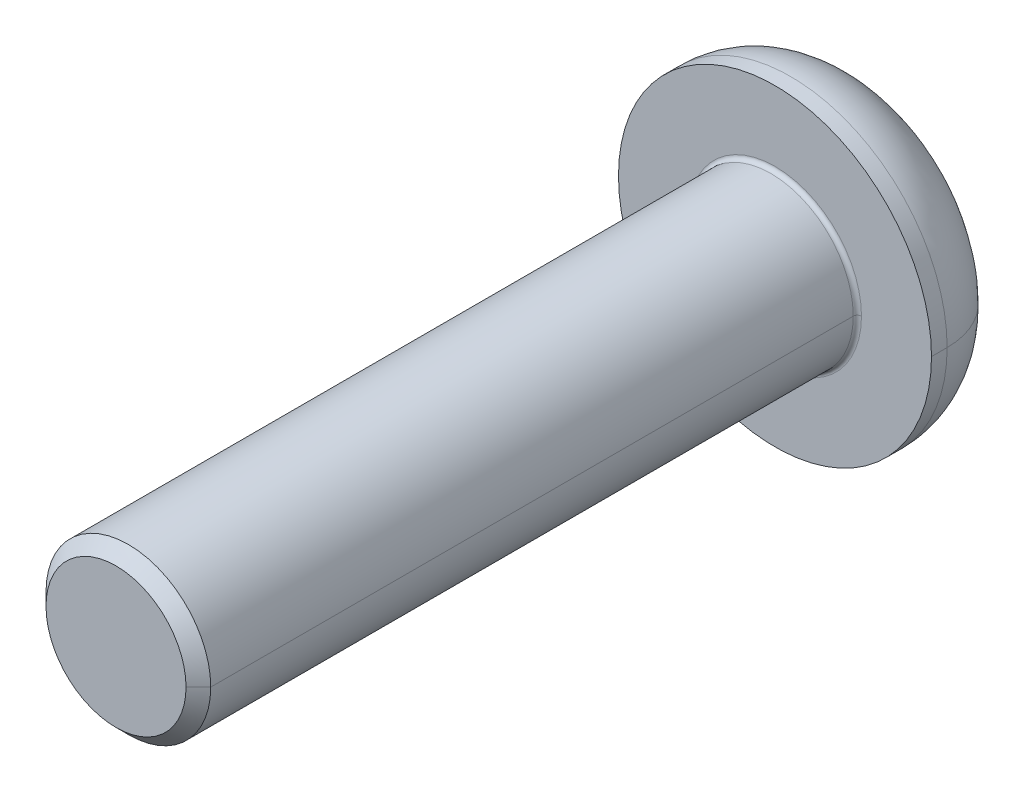
ISO-10303-21;
HEADER;
FILE_DESCRIPTION(('STEP AP214'),'2;1');
FILE_NAME('part.step','',(''),(''),'','','');
FILE_SCHEMA(('AUTOMOTIVE_DESIGN { 1 0 10303 214 1 1 1 1 }'));
ENDSEC;
DATA;
#1=APPLICATION_CONTEXT('core data for automotive mechanical design processes');
#2=APPLICATION_PROTOCOL_DEFINITION('international standard','automotive_design',2000,#1);
#3=PRODUCT_CONTEXT('',#1,'mechanical');
#4=PRODUCT('Part','Part','',(#3));
#5=PRODUCT_RELATED_PRODUCT_CATEGORY('part','',(#4));
#6=PRODUCT_DEFINITION_FORMATION('','',#4);
#7=PRODUCT_DEFINITION_CONTEXT('part definition',#1,'design');
#8=PRODUCT_DEFINITION('design','',#6,#7);
#9=PRODUCT_DEFINITION_SHAPE('','',#8);
#10=(LENGTH_UNIT() NAMED_UNIT(*) SI_UNIT(.MILLI.,.METRE.));
#11=(NAMED_UNIT(*) PLANE_ANGLE_UNIT() SI_UNIT($,.RADIAN.));
#12=(NAMED_UNIT(*) SI_UNIT($,.STERADIAN.) SOLID_ANGLE_UNIT());
#13=UNCERTAINTY_MEASURE_WITH_UNIT(LENGTH_MEASURE(1.E-05),#10,'distance_accuracy_value','');
#14=(GEOMETRIC_REPRESENTATION_CONTEXT(3) GLOBAL_UNCERTAINTY_ASSIGNED_CONTEXT((#13)) GLOBAL_UNIT_ASSIGNED_CONTEXT((#10,
#11,#12)) REPRESENTATION_CONTEXT('',''));
#15=CARTESIAN_POINT('',(0.,0.,0.));
#16=DIRECTION('',(0.,0.,1.));
#17=DIRECTION('',(1.,0.,0.));
#18=AXIS2_PLACEMENT_3D('',#15,#16,#17);
#19=CARTESIAN_POINT('',(0.,0.,0.1));
#20=DIRECTION('',(0.,0.,-1.));
#21=DIRECTION('',(-1.,0.,0.));
#22=AXIS2_PLACEMENT_3D('',#19,#20,#21);
#23=TOROIDAL_SURFACE('',#22,2.1,0.1);
#24=CARTESIAN_POINT('',(2.1,0.,0.1));
#25=DIRECTION('',(0.,1.,0.));
#26=DIRECTION('',(-1.,0.,0.));
#27=AXIS2_PLACEMENT_3D('',#24,#25,#26);
#28=CIRCLE('',#27,0.1);
#29=CARTESIAN_POINT('',(2.1,0.,0.));
#30=VERTEX_POINT('',#29);
#31=CARTESIAN_POINT('',(2.,0.,0.1));
#32=VERTEX_POINT('',#31);
#33=EDGE_CURVE('E272',#30,#32,#28,.T.);
#34=ORIENTED_EDGE('',*,*,#33,.F.);
#35=CARTESIAN_POINT('',(0.,0.,0.));
#36=DIRECTION('',(0.,0.,-1.));
#37=DIRECTION('',(-1.,0.,0.));
#38=AXIS2_PLACEMENT_3D('',#35,#36,#37);
#39=CIRCLE('',#38,2.1);
#40=CARTESIAN_POINT('',(-2.1,0.,0.));
#41=VERTEX_POINT('',#40);
#42=EDGE_CURVE('E163',#41,#30,#39,.T.);
#43=ORIENTED_EDGE('',*,*,#42,.F.);
#44=CARTESIAN_POINT('',(-2.1,0.,0.1));
#45=DIRECTION('',(0.,-1.,0.));
#46=DIRECTION('',(0.,0.,-1.));
#47=AXIS2_PLACEMENT_3D('',#44,#45,#46);
#48=CIRCLE('',#47,0.1);
#49=CARTESIAN_POINT('',(-2.,0.,0.1));
#50=VERTEX_POINT('',#49);
#51=EDGE_CURVE('E286',#41,#50,#48,.T.);
#52=ORIENTED_EDGE('',*,*,#51,.T.);
#53=CARTESIAN_POINT('',(0.,0.,0.1));
#54=DIRECTION('',(0.,0.,1.));
#55=DIRECTION('',(-1.,0.,0.));
#56=AXIS2_PLACEMENT_3D('',#53,#54,#55);
#57=CIRCLE('',#56,2.);
#58=EDGE_CURVE('E281',#32,#50,#57,.T.);
#59=ORIENTED_EDGE('',*,*,#58,.F.);
#60=EDGE_LOOP('',(#34,#43,#52,#59));
#61=FACE_BOUND('',#60,.T.);
#62=ADVANCED_FACE('F17',(#61),#23,.F.);
#63=CARTESIAN_POINT('',(0.,0.,-0.38));
#64=DIRECTION('',(0.,0.,-1.));
#65=DIRECTION('',(-1.,0.,0.));
#66=AXIS2_PLACEMENT_3D('',#63,#64,#65);
#67=TOROIDAL_SURFACE('',#66,1.98,1.82);
#68=CARTESIAN_POINT('',(1.98,0.,-0.38));
#69=DIRECTION('',(0.,1.,0.));
#70=DIRECTION('',(-1.,0.,0.));
#71=AXIS2_PLACEMENT_3D('',#68,#69,#70);
#72=CIRCLE('',#71,1.82);
#73=CARTESIAN_POINT('',(3.8,0.,-0.38));
#74=VERTEX_POINT('',#73);
#75=CARTESIAN_POINT('',(1.98,0.,-2.2));
#76=VERTEX_POINT('',#75);
#77=EDGE_CURVE('E290',#74,#76,#72,.T.);
#78=ORIENTED_EDGE('',*,*,#77,.F.);
#79=CARTESIAN_POINT('',(0.,0.,-0.38));
#80=DIRECTION('',(0.,0.,1.));
#81=DIRECTION('',(-1.,0.,0.));
#82=AXIS2_PLACEMENT_3D('',#79,#80,#81);
#83=CIRCLE('',#82,3.8);
#84=CARTESIAN_POINT('',(-3.8,0.,-0.38));
#85=VERTEX_POINT('',#84);
#86=EDGE_CURVE('E246',#85,#74,#83,.T.);
#87=ORIENTED_EDGE('',*,*,#86,.F.);
#88=CARTESIAN_POINT('',(-1.98,0.,-0.38));
#89=DIRECTION('',(0.,-1.,0.));
#90=DIRECTION('',(0.,0.,-1.));
#91=AXIS2_PLACEMENT_3D('',#88,#89,#90);
#92=CIRCLE('',#91,1.82);
#93=CARTESIAN_POINT('',(-1.98,0.,-2.2));
#94=VERTEX_POINT('',#93);
#95=EDGE_CURVE('E297',#85,#94,#92,.T.);
#96=ORIENTED_EDGE('',*,*,#95,.T.);
#97=CARTESIAN_POINT('',(0.,0.,-2.2));
#98=DIRECTION('',(0.,0.,-1.));
#99=DIRECTION('',(-1.,0.,0.));
#100=AXIS2_PLACEMENT_3D('',#97,#98,#99);
#101=CIRCLE('',#100,1.98);
#102=EDGE_CURVE('E227',#76,#94,#101,.T.);
#103=ORIENTED_EDGE('',*,*,#102,.F.);
#104=EDGE_LOOP('',(#78,#87,#96,#103));
#105=FACE_BOUND('',#104,.T.);
#106=ADVANCED_FACE('F376',(#105),#67,.T.);
#107=CARTESIAN_POINT('',(0.,0.,-0.9));
#108=DIRECTION('',(0.,0.,-1.));
#109=DIRECTION('',(0.,-1.,0.));
#110=AXIS2_PLACEMENT_3D('',#107,#108,#109);
#111=PLANE('',#110);
#112=DIRECTION('',(-1.,0.,0.));
#113=VECTOR('',#112,1.);
#114=CARTESIAN_POINT('',(0.721687836487032,-1.25,-0.9));
#115=LINE('',#114,#113);
#116=CARTESIAN_POINT('',(0.721687836487032,-1.25,-0.9));
#117=VERTEX_POINT('',#116);
#118=CARTESIAN_POINT('',(-0.721687836487032,-1.25,-0.9));
#119=VERTEX_POINT('',#118);
#120=EDGE_CURVE('E149',#117,#119,#115,.T.);
#121=ORIENTED_EDGE('',*,*,#120,.T.);
#122=DIRECTION('',(-0.5,0.866025403784439,0.));
#123=VECTOR('',#122,1.);
#124=CARTESIAN_POINT('',(-0.721687836487032,-1.25,-0.9));
#125=LINE('',#124,#123);
#126=CARTESIAN_POINT('',(-1.44337567297406,0.,-0.9));
#127=VERTEX_POINT('',#126);
#128=EDGE_CURVE('E11',#119,#127,#125,.T.);
#129=ORIENTED_EDGE('',*,*,#128,.T.);
#130=DIRECTION('',(0.5,0.866025403784439,0.));
#131=VECTOR('',#130,1.);
#132=CARTESIAN_POINT('',(-1.44337567297406,0.,-0.9));
#133=LINE('',#132,#131);
#134=CARTESIAN_POINT('',(-0.721687836487033,1.25,-0.9));
#135=VERTEX_POINT('',#134);
#136=EDGE_CURVE('E20',#127,#135,#133,.T.);
#137=ORIENTED_EDGE('',*,*,#136,.T.);
#138=DIRECTION('',(1.,0.,0.));
#139=VECTOR('',#138,1.);
#140=CARTESIAN_POINT('',(-0.721687836487033,1.25,-0.9));
#141=LINE('',#140,#139);
#142=CARTESIAN_POINT('',(0.721687836487032,1.25,-0.9));
#143=VERTEX_POINT('',#142);
#144=EDGE_CURVE('E183',#135,#143,#141,.T.);
#145=ORIENTED_EDGE('',*,*,#144,.T.);
#146=DIRECTION('',(0.5,-0.866025403784439,0.));
#147=VECTOR('',#146,1.);
#148=CARTESIAN_POINT('',(0.721687836487032,1.25,-0.9));
#149=LINE('',#148,#147);
#150=CARTESIAN_POINT('',(1.44337567297406,0.,-0.9));
#151=VERTEX_POINT('',#150);
#152=EDGE_CURVE('E178',#143,#151,#149,.T.);
#153=ORIENTED_EDGE('',*,*,#152,.T.);
#154=DIRECTION('',(-0.5,-0.866025403784439,0.));
#155=VECTOR('',#154,1.);
#156=CARTESIAN_POINT('',(1.44337567297406,0.,-0.9));
#157=LINE('',#156,#155);
#158=EDGE_CURVE('E152',#151,#117,#157,.T.);
#159=ORIENTED_EDGE('',*,*,#158,.T.);
#160=EDGE_LOOP('',(#121,#129,#137,#145,#153,#159));
#161=FACE_BOUND('',#160,.T.);
#162=ADVANCED_FACE('F150',(#161),#111,.T.);
#163=CARTESIAN_POINT('',(-0.721687836487032,-1.25,-0.9));
#164=DIRECTION('',(-0.866025403784439,-0.5,0.));
#165=DIRECTION('',(-0.5,0.866025403784439,0.));
#166=AXIS2_PLACEMENT_3D('',#163,#164,#165);
#167=PLANE('',#166);
#168=DIRECTION('',(-0.5,0.866025403784439,0.));
#169=VECTOR('',#168,1.);
#170=CARTESIAN_POINT('',(-0.721687836487032,-1.25,-2.2));
#171=LINE('',#170,#169);
#172=CARTESIAN_POINT('',(-0.721687836487032,-1.25,-2.2));
#173=VERTEX_POINT('',#172);
#174=CARTESIAN_POINT('',(-1.44337567297406,0.,-2.2));
#175=VERTEX_POINT('',#174);
#176=EDGE_CURVE('E169',#173,#175,#171,.T.);
#177=ORIENTED_EDGE('',*,*,#176,.T.);
#178=DIRECTION('',(0.,0.,-1.));
#179=VECTOR('',#178,1.);
#180=CARTESIAN_POINT('',(-1.44337567297406,0.,-0.9));
#181=LINE('',#180,#179);
#182=EDGE_CURVE('E26',#127,#175,#181,.T.);
#183=ORIENTED_EDGE('',*,*,#182,.F.);
#184=ORIENTED_EDGE('',*,*,#128,.F.);
#185=DIRECTION('',(0.,0.,-1.));
#186=VECTOR('',#185,1.);
#187=CARTESIAN_POINT('',(-0.721687836487032,-1.25,-0.9));
#188=LINE('',#187,#186);
#189=EDGE_CURVE('E146',#119,#173,#188,.T.);
#190=ORIENTED_EDGE('',*,*,#189,.T.);
#191=EDGE_LOOP('',(#177,#183,#184,#190));
#192=FACE_BOUND('',#191,.T.);
#193=ADVANCED_FACE('F144',(#192),#167,.F.);
#194=CARTESIAN_POINT('',(-1.44337567297406,0.,-0.9));
#195=DIRECTION('',(-0.866025403784439,0.5,0.));
#196=DIRECTION('',(0.,0.,1.));
#197=AXIS2_PLACEMENT_3D('',#194,#195,#196);
#198=PLANE('',#197);
#199=DIRECTION('',(0.5,0.866025403784439,0.));
#200=VECTOR('',#199,1.);
#201=CARTESIAN_POINT('',(-1.44337567297406,0.,-2.2));
#202=LINE('',#201,#200);
#203=CARTESIAN_POINT('',(-0.721687836487033,1.25,-2.2));
#204=VERTEX_POINT('',#203);
#205=EDGE_CURVE('E199',#175,#204,#202,.T.);
#206=ORIENTED_EDGE('',*,*,#205,.T.);
#207=DIRECTION('',(0.,0.,-1.));
#208=VECTOR('',#207,1.);
#209=CARTESIAN_POINT('',(-0.721687836487033,1.25,-0.9));
#210=LINE('',#209,#208);
#211=EDGE_CURVE('E185',#135,#204,#210,.T.);
#212=ORIENTED_EDGE('',*,*,#211,.F.);
#213=ORIENTED_EDGE('',*,*,#136,.F.);
#214=ORIENTED_EDGE('',*,*,#182,.T.);
#215=EDGE_LOOP('',(#206,#212,#213,#214));
#216=FACE_BOUND('',#215,.T.);
#217=ADVANCED_FACE('F396',(#216),#198,.F.);
#218=CARTESIAN_POINT('',(-0.721687836487033,1.25,-0.9));
#219=DIRECTION('',(0.,1.,0.));
#220=DIRECTION('',(1.,0.,0.));
#221=AXIS2_PLACEMENT_3D('',#218,#219,#220);
#222=PLANE('',#221);
#223=DIRECTION('',(1.,0.,0.));
#224=VECTOR('',#223,1.);
#225=CARTESIAN_POINT('',(-0.721687836487033,1.25,-2.2));
#226=LINE('',#225,#224);
#227=CARTESIAN_POINT('',(0.721687836487032,1.25,-2.2));
#228=VERTEX_POINT('',#227);
#229=EDGE_CURVE('E218',#204,#228,#226,.T.);
#230=ORIENTED_EDGE('',*,*,#229,.T.);
#231=DIRECTION('',(0.,0.,-1.));
#232=VECTOR('',#231,1.);
#233=CARTESIAN_POINT('',(0.721687836487032,1.25,-0.9));
#234=LINE('',#233,#232);
#235=EDGE_CURVE('E181',#143,#228,#234,.T.);
#236=ORIENTED_EDGE('',*,*,#235,.F.);
#237=ORIENTED_EDGE('',*,*,#144,.F.);
#238=ORIENTED_EDGE('',*,*,#211,.T.);
#239=EDGE_LOOP('',(#230,#236,#237,#238));
#240=FACE_BOUND('',#239,.T.);
#241=ADVANCED_FACE('F401',(#240),#222,.F.);
#242=CARTESIAN_POINT('',(0.721687836487032,1.25,-0.9));
#243=DIRECTION('',(0.866025403784439,0.5,0.));
#244=DIRECTION('',(0.,0.,-1.));
#245=AXIS2_PLACEMENT_3D('',#242,#243,#244);
#246=PLANE('',#245);
#247=DIRECTION('',(0.5,-0.866025403784439,0.));
#248=VECTOR('',#247,1.);
#249=CARTESIAN_POINT('',(0.721687836487032,1.25,-2.2));
#250=LINE('',#249,#248);
#251=CARTESIAN_POINT('',(1.44337567297406,0.,-2.2));
#252=VERTEX_POINT('',#251);
#253=EDGE_CURVE('E213',#228,#252,#250,.T.);
#254=ORIENTED_EDGE('',*,*,#253,.T.);
#255=DIRECTION('',(0.,0.,-1.));
#256=VECTOR('',#255,1.);
#257=CARTESIAN_POINT('',(1.44337567297406,0.,-0.9));
#258=LINE('',#257,#256);
#259=EDGE_CURVE('E177',#151,#252,#258,.T.);
#260=ORIENTED_EDGE('',*,*,#259,.F.);
#261=ORIENTED_EDGE('',*,*,#152,.F.);
#262=ORIENTED_EDGE('',*,*,#235,.T.);
#263=EDGE_LOOP('',(#254,#260,#261,#262));
#264=FACE_BOUND('',#263,.T.);
#265=ADVANCED_FACE('F214',(#264),#246,.F.);
#266=CARTESIAN_POINT('',(1.44337567297406,0.,-0.9));
#267=DIRECTION('',(0.866025403784439,-0.5,0.));
#268=DIRECTION('',(0.,0.,-1.));
#269=AXIS2_PLACEMENT_3D('',#266,#267,#268);
#270=PLANE('',#269);
#271=DIRECTION('',(-0.5,-0.866025403784439,0.));
#272=VECTOR('',#271,1.);
#273=CARTESIAN_POINT('',(1.44337567297406,0.,-2.2));
#274=LINE('',#273,#272);
#275=CARTESIAN_POINT('',(0.721687836487032,-1.25,-2.2));
#276=VERTEX_POINT('',#275);
#277=EDGE_CURVE('E209',#252,#276,#274,.T.);
#278=ORIENTED_EDGE('',*,*,#277,.T.);
#279=DIRECTION('',(0.,0.,-1.));
#280=VECTOR('',#279,1.);
#281=CARTESIAN_POINT('',(0.721687836487032,-1.25,-0.9));
#282=LINE('',#281,#280);
#283=EDGE_CURVE('E156',#117,#276,#282,.T.);
#284=ORIENTED_EDGE('',*,*,#283,.F.);
#285=ORIENTED_EDGE('',*,*,#158,.F.);
#286=ORIENTED_EDGE('',*,*,#259,.T.);
#287=EDGE_LOOP('',(#278,#284,#285,#286));
#288=FACE_BOUND('',#287,.T.);
#289=ADVANCED_FACE('F207',(#288),#270,.F.);
#290=CARTESIAN_POINT('',(0.721687836487032,-1.25,-0.9));
#291=DIRECTION('',(0.,-1.,0.));
#292=DIRECTION('',(-1.,0.,0.));
#293=AXIS2_PLACEMENT_3D('',#290,#291,#292);
#294=PLANE('',#293);
#295=DIRECTION('',(-1.,0.,0.));
#296=VECTOR('',#295,1.);
#297=CARTESIAN_POINT('',(0.721687836487032,-1.25,-2.2));
#298=LINE('',#297,#296);
#299=EDGE_CURVE('E161',#276,#173,#298,.T.);
#300=ORIENTED_EDGE('',*,*,#299,.T.);
#301=ORIENTED_EDGE('',*,*,#189,.F.);
#302=ORIENTED_EDGE('',*,*,#120,.F.);
#303=ORIENTED_EDGE('',*,*,#283,.T.);
#304=EDGE_LOOP('',(#300,#301,#302,#303));
#305=FACE_BOUND('',#304,.T.);
#306=ADVANCED_FACE('F159',(#305),#294,.F.);
#307=CARTESIAN_POINT('',(0.,0.,0.));
#308=DIRECTION('',(0.,0.,-1.));
#309=DIRECTION('',(0.,-1.,0.));
#310=AXIS2_PLACEMENT_3D('',#307,#308,#309);
#311=PLANE('',#310);
#312=ORIENTED_EDGE('',*,*,#42,.T.);
#313=CARTESIAN_POINT('',(0.,0.,0.));
#314=DIRECTION('',(0.,0.,-1.));
#315=DIRECTION('',(-1.,0.,0.));
#316=AXIS2_PLACEMENT_3D('',#313,#314,#315);
#317=CIRCLE('',#316,2.1);
#318=EDGE_CURVE('E268',#30,#41,#317,.T.);
#319=ORIENTED_EDGE('',*,*,#318,.T.);
#320=EDGE_LOOP('',(#312,#319));
#321=FACE_BOUND('',#320,.T.);
#322=CARTESIAN_POINT('',(0.,0.,0.));
#323=DIRECTION('',(0.,0.,-1.));
#324=DIRECTION('',(-1.,0.,0.));
#325=AXIS2_PLACEMENT_3D('',#322,#323,#324);
#326=CIRCLE('',#325,3.8);
#327=CARTESIAN_POINT('',(3.8,0.,0.));
#328=VERTEX_POINT('',#327);
#329=CARTESIAN_POINT('',(-3.8,0.,0.));
#330=VERTEX_POINT('',#329);
#331=EDGE_CURVE('E249',#328,#330,#326,.T.);
#332=ORIENTED_EDGE('',*,*,#331,.F.);
#333=CARTESIAN_POINT('',(0.,0.,0.));
#334=DIRECTION('',(0.,0.,-1.));
#335=DIRECTION('',(-1.,0.,0.));
#336=AXIS2_PLACEMENT_3D('',#333,#334,#335);
#337=CIRCLE('',#336,3.8);
#338=EDGE_CURVE('E304',#330,#328,#337,.T.);
#339=ORIENTED_EDGE('',*,*,#338,.F.);
#340=EDGE_LOOP('',(#332,#339));
#341=FACE_BOUND('',#340,.T.);
#342=ADVANCED_FACE('F360',(#321,#341),#311,.F.);
#343=CARTESIAN_POINT('',(0.,0.,-2.2));
#344=DIRECTION('',(0.,0.,-1.));
#345=DIRECTION('',(0.,-1.,0.));
#346=AXIS2_PLACEMENT_3D('',#343,#344,#345);
#347=PLANE('',#346);
#348=ORIENTED_EDGE('',*,*,#299,.F.);
#349=ORIENTED_EDGE('',*,*,#277,.F.);
#350=ORIENTED_EDGE('',*,*,#253,.F.);
#351=ORIENTED_EDGE('',*,*,#229,.F.);
#352=ORIENTED_EDGE('',*,*,#205,.F.);
#353=ORIENTED_EDGE('',*,*,#176,.F.);
#354=EDGE_LOOP('',(#348,#349,#350,#351,#352,#353));
#355=FACE_BOUND('',#354,.T.);
#356=CARTESIAN_POINT('',(0.,0.,-2.2));
#357=DIRECTION('',(0.,0.,-1.));
#358=DIRECTION('',(-1.,0.,0.));
#359=AXIS2_PLACEMENT_3D('',#356,#357,#358);
#360=CIRCLE('',#359,1.98);
#361=EDGE_CURVE('E294',#94,#76,#360,.T.);
#362=ORIENTED_EDGE('',*,*,#361,.T.);
#363=ORIENTED_EDGE('',*,*,#102,.T.);
#364=EDGE_LOOP('',(#362,#363));
#365=FACE_BOUND('',#364,.T.);
#366=ADVANCED_FACE('F220',(#355,#365),#347,.T.);
#367=CARTESIAN_POINT('',(0.,0.,-2.2));
#368=DIRECTION('',(0.,0.,1.));
#369=DIRECTION('',(1.,0.,0.));
#370=AXIS2_PLACEMENT_3D('',#367,#368,#369);
#371=CYLINDRICAL_SURFACE('',#370,3.8);
#372=DIRECTION('',(0.,0.,1.));
#373=VECTOR('',#372,1.);
#374=CARTESIAN_POINT('',(-3.8,0.,-2.2));
#375=LINE('',#374,#373);
#376=EDGE_CURVE('E300',#85,#330,#375,.T.);
#377=ORIENTED_EDGE('',*,*,#376,.F.);
#378=ORIENTED_EDGE('',*,*,#86,.T.);
#379=DIRECTION('',(0.,0.,1.));
#380=VECTOR('',#379,1.);
#381=CARTESIAN_POINT('',(3.8,0.,-2.2));
#382=LINE('',#381,#380);
#383=EDGE_CURVE('E308',#74,#328,#382,.T.);
#384=ORIENTED_EDGE('',*,*,#383,.T.);
#385=ORIENTED_EDGE('',*,*,#331,.T.);
#386=EDGE_LOOP('',(#377,#378,#384,#385));
#387=FACE_BOUND('',#386,.T.);
#388=ADVANCED_FACE('F365',(#387),#371,.T.);
#389=CARTESIAN_POINT('',(0.,0.,16.));
#390=DIRECTION('',(0.,0.,-1.));
#391=DIRECTION('',(-1.,0.,0.));
#392=AXIS2_PLACEMENT_3D('',#389,#390,#391);
#393=CONICAL_SURFACE('',#392,1.7,0.785398163397442);
#394=DIRECTION('',(0.707106781186544,0.,-0.707106781186552));
#395=VECTOR('',#394,1.);
#396=CARTESIAN_POINT('',(1.7,0.,16.));
#397=LINE('',#396,#395);
#398=CARTESIAN_POINT('',(1.7,0.,16.));
#399=VERTEX_POINT('',#398);
#400=CARTESIAN_POINT('',(2.,0.,15.7));
#401=VERTEX_POINT('',#400);
#402=EDGE_CURVE('E315',#399,#401,#397,.T.);
#403=ORIENTED_EDGE('',*,*,#402,.F.);
#404=CARTESIAN_POINT('',(0.,0.,16.));
#405=DIRECTION('',(0.,0.,1.));
#406=DIRECTION('',(1.,0.,0.));
#407=AXIS2_PLACEMENT_3D('',#404,#405,#406);
#408=CIRCLE('',#407,1.7);
#409=CARTESIAN_POINT('',(-1.7,0.,16.));
#410=VERTEX_POINT('',#409);
#411=EDGE_CURVE('E263',#410,#399,#408,.T.);
#412=ORIENTED_EDGE('',*,*,#411,.F.);
#413=DIRECTION('',(-0.707106781186544,0.,-0.707106781186552));
#414=VECTOR('',#413,1.);
#415=CARTESIAN_POINT('',(-1.7,0.,16.));
#416=LINE('',#415,#414);
#417=CARTESIAN_POINT('',(-2.,0.,15.7));
#418=VERTEX_POINT('',#417);
#419=EDGE_CURVE('E282',#410,#418,#416,.T.);
#420=ORIENTED_EDGE('',*,*,#419,.T.);
#421=CARTESIAN_POINT('',(0.,0.,15.7));
#422=DIRECTION('',(0.,0.,-1.));
#423=DIRECTION('',(1.,0.,0.));
#424=AXIS2_PLACEMENT_3D('',#421,#422,#423);
#425=CIRCLE('',#424,2.);
#426=EDGE_CURVE('E328',#401,#418,#425,.T.);
#427=ORIENTED_EDGE('',*,*,#426,.F.);
#428=EDGE_LOOP('',(#403,#412,#420,#427));
#429=FACE_BOUND('',#428,.T.);
#430=ADVANCED_FACE('F341',(#429),#393,.T.);
#431=CARTESIAN_POINT('',(0.,0.,16.));
#432=DIRECTION('',(0.,0.,1.));
#433=DIRECTION('',(1.,0.,0.));
#434=AXIS2_PLACEMENT_3D('',#431,#432,#433);
#435=PLANE('',#434);
#436=ORIENTED_EDGE('',*,*,#411,.T.);
#437=CARTESIAN_POINT('',(0.,0.,16.));
#438=DIRECTION('',(0.,0.,1.));
#439=DIRECTION('',(1.,0.,0.));
#440=AXIS2_PLACEMENT_3D('',#437,#438,#439);
#441=CIRCLE('',#440,1.7);
#442=EDGE_CURVE('E311',#399,#410,#441,.T.);
#443=ORIENTED_EDGE('',*,*,#442,.T.);
#444=EDGE_LOOP('',(#436,#443));
#445=FACE_BOUND('',#444,.T.);
#446=ADVANCED_FACE('F336',(#445),#435,.T.);
#447=CARTESIAN_POINT('',(0.,0.,16.));
#448=DIRECTION('',(0.,0.,-1.));
#449=DIRECTION('',(-1.,0.,0.));
#450=AXIS2_PLACEMENT_3D('',#447,#448,#449);
#451=CYLINDRICAL_SURFACE('',#450,2.);
#452=DIRECTION('',(0.,0.,-1.));
#453=VECTOR('',#452,1.);
#454=CARTESIAN_POINT('',(2.,0.,16.));
#455=LINE('',#454,#453);
#456=EDGE_CURVE('E277',#401,#32,#455,.T.);
#457=ORIENTED_EDGE('',*,*,#456,.F.);
#458=ORIENTED_EDGE('',*,*,#426,.T.);
#459=DIRECTION('',(0.,0.,-1.));
#460=VECTOR('',#459,1.);
#461=CARTESIAN_POINT('',(-2.,0.,16.));
#462=LINE('',#461,#460);
#463=EDGE_CURVE('E326',#418,#50,#462,.T.);
#464=ORIENTED_EDGE('',*,*,#463,.T.);
#465=CARTESIAN_POINT('',(0.,0.,0.1));
#466=DIRECTION('',(0.,0.,1.));
#467=DIRECTION('',(-1.,0.,0.));
#468=AXIS2_PLACEMENT_3D('',#465,#466,#467);
#469=CIRCLE('',#468,2.);
#470=EDGE_CURVE('E276',#50,#32,#469,.T.);
#471=ORIENTED_EDGE('',*,*,#470,.T.);
#472=EDGE_LOOP('',(#457,#458,#464,#471));
#473=FACE_BOUND('',#472,.T.);
#474=ADVANCED_FACE('F351',(#473),#451,.T.);
#475=CARTESIAN_POINT('',(0.,0.,16.));
#476=DIRECTION('',(0.,0.,-1.));
#477=DIRECTION('',(-1.,0.,0.));
#478=AXIS2_PLACEMENT_3D('',#475,#476,#477);
#479=CYLINDRICAL_SURFACE('',#478,2.);
#480=CARTESIAN_POINT('',(0.,0.,15.7));
#481=DIRECTION('',(0.,0.,-1.));
#482=DIRECTION('',(1.,0.,0.));
#483=AXIS2_PLACEMENT_3D('',#480,#481,#482);
#484=CIRCLE('',#483,2.);
#485=EDGE_CURVE('E319',#418,#401,#484,.T.);
#486=ORIENTED_EDGE('',*,*,#485,.T.);
#487=ORIENTED_EDGE('',*,*,#456,.T.);
#488=ORIENTED_EDGE('',*,*,#58,.T.);
#489=ORIENTED_EDGE('',*,*,#463,.F.);
#490=EDGE_LOOP('',(#486,#487,#488,#489));
#491=FACE_BOUND('',#490,.T.);
#492=ADVANCED_FACE('F349',(#491),#479,.T.);
#493=CARTESIAN_POINT('',(0.,0.,16.));
#494=DIRECTION('',(0.,0.,-1.));
#495=DIRECTION('',(-1.,0.,0.));
#496=AXIS2_PLACEMENT_3D('',#493,#494,#495);
#497=CONICAL_SURFACE('',#496,1.7,0.785398163397442);
#498=ORIENTED_EDGE('',*,*,#442,.F.);
#499=ORIENTED_EDGE('',*,*,#402,.T.);
#500=ORIENTED_EDGE('',*,*,#485,.F.);
#501=ORIENTED_EDGE('',*,*,#419,.F.);
#502=EDGE_LOOP('',(#498,#499,#500,#501));
#503=FACE_BOUND('',#502,.T.);
#504=ADVANCED_FACE('F346',(#503),#497,.T.);
#505=CARTESIAN_POINT('',(0.,0.,-2.2));
#506=DIRECTION('',(0.,0.,1.));
#507=DIRECTION('',(1.,0.,0.));
#508=AXIS2_PLACEMENT_3D('',#505,#506,#507);
#509=CYLINDRICAL_SURFACE('',#508,3.8);
#510=CARTESIAN_POINT('',(0.,0.,-0.38));
#511=DIRECTION('',(0.,0.,1.));
#512=DIRECTION('',(-1.,0.,0.));
#513=AXIS2_PLACEMENT_3D('',#510,#511,#512);
#514=CIRCLE('',#513,3.8);
#515=EDGE_CURVE('E266',#74,#85,#514,.T.);
#516=ORIENTED_EDGE('',*,*,#515,.T.);
#517=ORIENTED_EDGE('',*,*,#376,.T.);
#518=ORIENTED_EDGE('',*,*,#338,.T.);
#519=ORIENTED_EDGE('',*,*,#383,.F.);
#520=EDGE_LOOP('',(#516,#517,#518,#519));
#521=FACE_BOUND('',#520,.T.);
#522=ADVANCED_FACE('F369',(#521),#509,.T.);
#523=CARTESIAN_POINT('',(0.,0.,-0.38));
#524=DIRECTION('',(0.,0.,-1.));
#525=DIRECTION('',(-1.,0.,0.));
#526=AXIS2_PLACEMENT_3D('',#523,#524,#525);
#527=TOROIDAL_SURFACE('',#526,1.98,1.82);
#528=ORIENTED_EDGE('',*,*,#515,.F.);
#529=ORIENTED_EDGE('',*,*,#77,.T.);
#530=ORIENTED_EDGE('',*,*,#361,.F.);
#531=ORIENTED_EDGE('',*,*,#95,.F.);
#532=EDGE_LOOP('',(#528,#529,#530,#531));
#533=FACE_BOUND('',#532,.T.);
#534=ADVANCED_FACE('F374',(#533),#527,.T.);
#535=CARTESIAN_POINT('',(0.,0.,0.1));
#536=DIRECTION('',(0.,0.,-1.));
#537=DIRECTION('',(-1.,0.,0.));
#538=AXIS2_PLACEMENT_3D('',#535,#536,#537);
#539=TOROIDAL_SURFACE('',#538,2.1,0.1);
#540=ORIENTED_EDGE('',*,*,#318,.F.);
#541=ORIENTED_EDGE('',*,*,#33,.T.);
#542=ORIENTED_EDGE('',*,*,#470,.F.);
#543=ORIENTED_EDGE('',*,*,#51,.F.);
#544=EDGE_LOOP('',(#540,#541,#542,#543));
#545=FACE_BOUND('',#544,.T.);
#546=ADVANCED_FACE('F357',(#545),#539,.F.);
#547=CLOSED_SHELL('',(#62,#106,#162,#193,#217,#241,#265,#289,#306,#342,#366,#388,#430,#446,#474,
#492,#504,#522,#534,#546));
#548=MANIFOLD_SOLID_BREP('B1',#547);
#549=ADVANCED_BREP_SHAPE_REPRESENTATION('',(#18,#548),#14);
#550=SHAPE_DEFINITION_REPRESENTATION(#9,#549);
ENDSEC;
END-ISO-10303-21;
